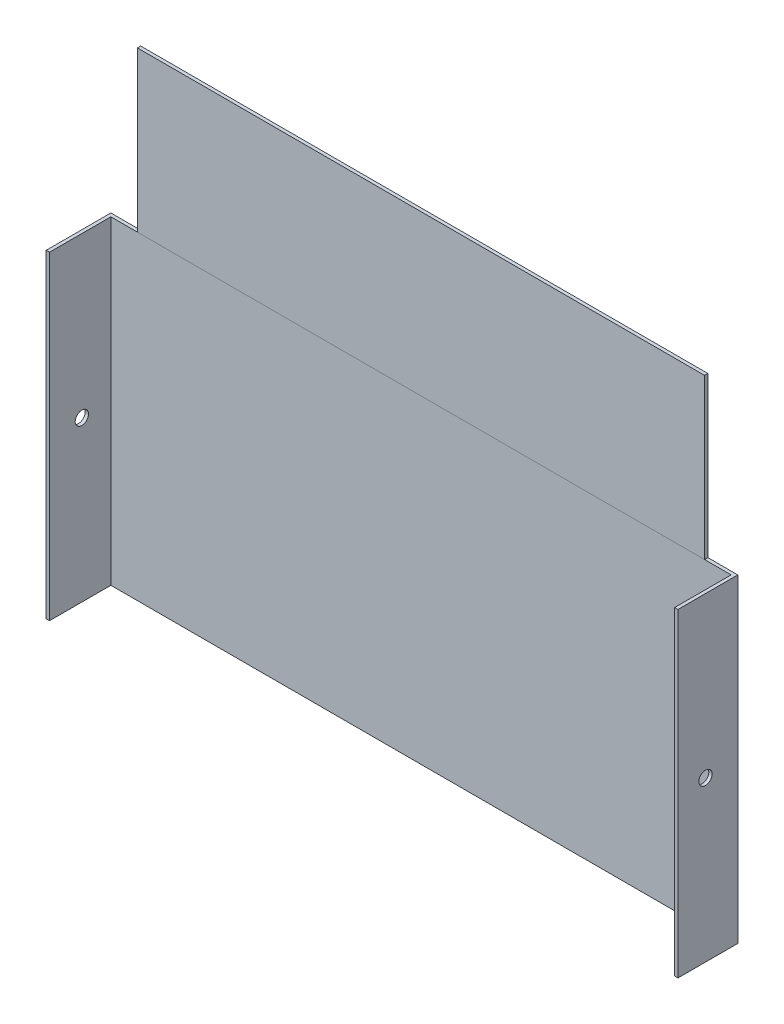
ISO-10303-21;
HEADER;
FILE_DESCRIPTION(('STEP AP214'),'2;1');
FILE_NAME('part.step','',(''),(''),'','','');
FILE_SCHEMA(('AUTOMOTIVE_DESIGN { 1 0 10303 214 1 1 1 1 }'));
ENDSEC;
DATA;
#1=APPLICATION_CONTEXT('core data for automotive mechanical design processes');
#2=APPLICATION_PROTOCOL_DEFINITION('international standard','automotive_design',2000,#1);
#3=PRODUCT_CONTEXT('',#1,'mechanical');
#4=PRODUCT('Part','Part','',(#3));
#5=PRODUCT_RELATED_PRODUCT_CATEGORY('part','',(#4));
#6=PRODUCT_DEFINITION_FORMATION('','',#4);
#7=PRODUCT_DEFINITION_CONTEXT('part definition',#1,'design');
#8=PRODUCT_DEFINITION('design','',#6,#7);
#9=PRODUCT_DEFINITION_SHAPE('','',#8);
#10=(LENGTH_UNIT() NAMED_UNIT(*) SI_UNIT(.MILLI.,.METRE.));
#11=(NAMED_UNIT(*) PLANE_ANGLE_UNIT() SI_UNIT($,.RADIAN.));
#12=(NAMED_UNIT(*) SI_UNIT($,.STERADIAN.) SOLID_ANGLE_UNIT());
#13=UNCERTAINTY_MEASURE_WITH_UNIT(LENGTH_MEASURE(1.E-05),#10,'distance_accuracy_value','');
#14=(GEOMETRIC_REPRESENTATION_CONTEXT(3) GLOBAL_UNCERTAINTY_ASSIGNED_CONTEXT((#13)) GLOBAL_UNIT_ASSIGNED_CONTEXT((#10,
#11,#12)) REPRESENTATION_CONTEXT('',''));
#15=CARTESIAN_POINT('',(0.,0.,0.));
#16=DIRECTION('',(0.,0.,1.));
#17=DIRECTION('',(1.,0.,0.));
#18=AXIS2_PLACEMENT_3D('',#15,#16,#17);
#19=CARTESIAN_POINT('',(0.,304.8,53.975));
#20=DIRECTION('',(0.,0.,-1.));
#21=DIRECTION('',(-1.,0.,0.));
#22=AXIS2_PLACEMENT_3D('',#19,#20,#21);
#23=PLANE('',#22);
#24=DIRECTION('',(1.,0.,0.));
#25=VECTOR('',#24,1.);
#26=CARTESIAN_POINT('',(0.,0.,53.975));
#27=LINE('',#26,#25);
#28=CARTESIAN_POINT('',(0.,0.,53.975));
#29=VERTEX_POINT('',#28);
#30=CARTESIAN_POINT('',(3.17500000000001,0.,53.975));
#31=VERTEX_POINT('',#30);
#32=EDGE_CURVE('E169',#29,#31,#27,.T.);
#33=ORIENTED_EDGE('',*,*,#32,.T.);
#34=DIRECTION('',(0.,-1.,0.));
#35=VECTOR('',#34,1.);
#36=CARTESIAN_POINT('',(3.17500000000001,304.8,53.975));
#37=LINE('',#36,#35);
#38=CARTESIAN_POINT('',(3.17500000000001,304.8,53.975));
#39=VERTEX_POINT('',#38);
#40=EDGE_CURVE('E223',#39,#31,#37,.T.);
#41=ORIENTED_EDGE('',*,*,#40,.F.);
#42=DIRECTION('',(1.,0.,0.));
#43=VECTOR('',#42,1.);
#44=CARTESIAN_POINT('',(0.,304.8,53.975));
#45=LINE('',#44,#43);
#46=CARTESIAN_POINT('',(0.,304.8,53.975));
#47=VERTEX_POINT('',#46);
#48=EDGE_CURVE('E173',#47,#39,#45,.T.);
#49=ORIENTED_EDGE('',*,*,#48,.F.);
#50=DIRECTION('',(0.,-1.,0.));
#51=VECTOR('',#50,1.);
#52=CARTESIAN_POINT('',(0.,304.8,53.975));
#53=LINE('',#52,#51);
#54=EDGE_CURVE('E36',#47,#29,#53,.T.);
#55=ORIENTED_EDGE('',*,*,#54,.T.);
#56=EDGE_LOOP('',(#33,#41,#49,#55));
#57=FACE_BOUND('',#56,.T.);
#58=ADVANCED_FACE('F33',(#57),#23,.F.);
#59=CARTESIAN_POINT('',(3.175,304.8,-4.56787261276633));
#60=DIRECTION('',(-1.,0.,0.));
#61=DIRECTION('',(0.,0.,1.));
#62=AXIS2_PLACEMENT_3D('',#59,#60,#61);
#63=PLANE('',#62);
#64=CARTESIAN_POINT('',(3.17500000000004,152.4,23.1160636936168));
#65=DIRECTION('',(-1.,0.,0.));
#66=DIRECTION('',(0.,0.,1.));
#67=AXIS2_PLACEMENT_3D('',#64,#65,#66);
#68=CIRCLE('',#67,6.35);
#69=CARTESIAN_POINT('',(3.17500000000004,152.4,29.4660636936168));
#70=VERTEX_POINT('',#69);
#71=EDGE_CURVE('E166',#70,#70,#68,.T.);
#72=ORIENTED_EDGE('',*,*,#71,.T.);
#73=EDGE_LOOP('',(#72));
#74=FACE_BOUND('',#73,.T.);
#75=DIRECTION('',(0.,0.,-1.));
#76=VECTOR('',#75,1.);
#77=CARTESIAN_POINT('',(3.175,0.,-4.56787261276633));
#78=LINE('',#77,#76);
#79=CARTESIAN_POINT('',(3.175,0.,-4.56787261276633));
#80=VERTEX_POINT('',#79);
#81=EDGE_CURVE('E193',#31,#80,#78,.T.);
#82=ORIENTED_EDGE('',*,*,#81,.T.);
#83=DIRECTION('',(0.,-1.,0.));
#84=VECTOR('',#83,1.);
#85=CARTESIAN_POINT('',(3.175,304.8,-4.56787261276633));
#86=LINE('',#85,#84);
#87=CARTESIAN_POINT('',(3.175,304.8,-4.56787261276633));
#88=VERTEX_POINT('',#87);
#89=EDGE_CURVE('E221',#88,#80,#86,.T.);
#90=ORIENTED_EDGE('',*,*,#89,.F.);
#91=DIRECTION('',(0.,0.,-1.));
#92=VECTOR('',#91,1.);
#93=CARTESIAN_POINT('',(3.175,304.8,-4.56787261276633));
#94=LINE('',#93,#92);
#95=EDGE_CURVE('E176',#39,#88,#94,.T.);
#96=ORIENTED_EDGE('',*,*,#95,.F.);
#97=ORIENTED_EDGE('',*,*,#40,.T.);
#98=EDGE_LOOP('',(#82,#90,#96,#97));
#99=FACE_BOUND('',#98,.T.);
#100=ADVANCED_FACE('F243',(#74,#99),#63,.F.);
#101=CARTESIAN_POINT('',(595.506256140345,304.8,-4.56787261276641));
#102=DIRECTION('',(0.,0.,-1.));
#103=DIRECTION('',(-1.,0.,0.));
#104=AXIS2_PLACEMENT_3D('',#101,#102,#103);
#105=PLANE('',#104);
#106=DIRECTION('',(1.,0.,0.));
#107=VECTOR('',#106,1.);
#108=CARTESIAN_POINT('',(595.506256140345,0.,-4.56787261276641));
#109=LINE('',#108,#107);
#110=CARTESIAN_POINT('',(595.506256140345,0.,-4.56787261276641));
#111=VERTEX_POINT('',#110);
#112=EDGE_CURVE('E195',#80,#111,#109,.T.);
#113=ORIENTED_EDGE('',*,*,#112,.T.);
#114=DIRECTION('',(0.,-1.,0.));
#115=VECTOR('',#114,1.);
#116=CARTESIAN_POINT('',(595.506256140345,304.8,-4.56787261276641));
#117=LINE('',#116,#115);
#118=CARTESIAN_POINT('',(595.506256140345,304.8,-4.56787261276641));
#119=VERTEX_POINT('',#118);
#120=EDGE_CURVE('E218',#119,#111,#117,.T.);
#121=ORIENTED_EDGE('',*,*,#120,.F.);
#122=DIRECTION('',(1.,0.,0.));
#123=VECTOR('',#122,1.);
#124=CARTESIAN_POINT('',(595.506256140345,304.8,-4.56787261276641));
#125=LINE('',#124,#123);
#126=CARTESIAN_POINT('',(570.106256140345,304.8,-4.5678726127664));
#127=VERTEX_POINT('',#126);
#128=EDGE_CURVE('E178',#127,#119,#125,.T.);
#129=ORIENTED_EDGE('',*,*,#128,.F.);
#130=CARTESIAN_POINT('',(28.575,304.8,-4.56787261276634));
#131=VERTEX_POINT('',#130);
#132=EDGE_CURVE('E182',#131,#127,#125,.T.);
#133=ORIENTED_EDGE('',*,*,#132,.F.);
#134=EDGE_CURVE('E179',#88,#131,#125,.T.);
#135=ORIENTED_EDGE('',*,*,#134,.F.);
#136=ORIENTED_EDGE('',*,*,#89,.T.);
#137=EDGE_LOOP('',(#113,#121,#129,#133,#135,#136));
#138=FACE_BOUND('',#137,.T.);
#139=ADVANCED_FACE('F246',(#138),#105,.F.);
#140=CARTESIAN_POINT('',(595.506256140345,304.8,-4.56787261276641));
#141=DIRECTION('',(1.,0.,0.));
#142=DIRECTION('',(0.,0.,-1.));
#143=AXIS2_PLACEMENT_3D('',#140,#141,#142);
#144=PLANE('',#143);
#145=CARTESIAN_POINT('',(595.506256140345,152.4,23.1160636936168));
#146=DIRECTION('',(1.,0.,0.));
#147=DIRECTION('',(0.,0.,-1.));
#148=AXIS2_PLACEMENT_3D('',#145,#146,#147);
#149=CIRCLE('',#148,6.35);
#150=CARTESIAN_POINT('',(595.506256140345,152.4,16.7660636936168));
#151=VERTEX_POINT('',#150);
#152=EDGE_CURVE('E162',#151,#151,#149,.T.);
#153=ORIENTED_EDGE('',*,*,#152,.T.);
#154=EDGE_LOOP('',(#153));
#155=FACE_BOUND('',#154,.T.);
#156=DIRECTION('',(0.,0.,1.));
#157=VECTOR('',#156,1.);
#158=CARTESIAN_POINT('',(595.506256140345,0.,-4.56787261276641));
#159=LINE('',#158,#157);
#160=CARTESIAN_POINT('',(595.506256140345,0.,49.4071273872337));
#161=VERTEX_POINT('',#160);
#162=EDGE_CURVE('E197',#111,#161,#159,.T.);
#163=ORIENTED_EDGE('',*,*,#162,.T.);
#164=DIRECTION('',(0.,-1.,0.));
#165=VECTOR('',#164,1.);
#166=CARTESIAN_POINT('',(595.506256140345,304.8,49.4071273872337));
#167=LINE('',#166,#165);
#168=CARTESIAN_POINT('',(595.506256140345,304.8,49.4071273872337));
#169=VERTEX_POINT('',#168);
#170=EDGE_CURVE('E215',#169,#161,#167,.T.);
#171=ORIENTED_EDGE('',*,*,#170,.F.);
#172=DIRECTION('',(0.,0.,1.));
#173=VECTOR('',#172,1.);
#174=CARTESIAN_POINT('',(595.506256140345,304.8,-4.56787261276641));
#175=LINE('',#174,#173);
#176=EDGE_CURVE('E181',#119,#169,#175,.T.);
#177=ORIENTED_EDGE('',*,*,#176,.F.);
#178=ORIENTED_EDGE('',*,*,#120,.T.);
#179=EDGE_LOOP('',(#163,#171,#177,#178));
#180=FACE_BOUND('',#179,.T.);
#181=ADVANCED_FACE('F284',(#155,#180),#144,.F.);
#182=CARTESIAN_POINT('',(598.681256140345,304.8,49.4071273872337));
#183=DIRECTION('',(0.,0.,-1.));
#184=DIRECTION('',(-1.,0.,0.));
#185=AXIS2_PLACEMENT_3D('',#182,#183,#184);
#186=PLANE('',#185);
#187=DIRECTION('',(1.,0.,0.));
#188=VECTOR('',#187,1.);
#189=CARTESIAN_POINT('',(598.681256140345,0.,49.4071273872337));
#190=LINE('',#189,#188);
#191=CARTESIAN_POINT('',(598.681256140345,0.,49.4071273872337));
#192=VERTEX_POINT('',#191);
#193=EDGE_CURVE('E199',#161,#192,#190,.T.);
#194=ORIENTED_EDGE('',*,*,#193,.T.);
#195=DIRECTION('',(0.,-1.,0.));
#196=VECTOR('',#195,1.);
#197=CARTESIAN_POINT('',(598.681256140345,304.8,49.4071273872337));
#198=LINE('',#197,#196);
#199=CARTESIAN_POINT('',(598.681256140345,304.8,49.4071273872337));
#200=VERTEX_POINT('',#199);
#201=EDGE_CURVE('E212',#200,#192,#198,.T.);
#202=ORIENTED_EDGE('',*,*,#201,.F.);
#203=DIRECTION('',(1.,0.,0.));
#204=VECTOR('',#203,1.);
#205=CARTESIAN_POINT('',(598.681256140345,304.8,49.4071273872337));
#206=LINE('',#205,#204);
#207=EDGE_CURVE('E184',#169,#200,#206,.T.);
#208=ORIENTED_EDGE('',*,*,#207,.F.);
#209=ORIENTED_EDGE('',*,*,#170,.T.);
#210=EDGE_LOOP('',(#194,#202,#208,#209));
#211=FACE_BOUND('',#210,.T.);
#212=ADVANCED_FACE('F289',(#211),#186,.F.);
#213=CARTESIAN_POINT('',(598.681256140345,304.8,-7.7428726127664));
#214=DIRECTION('',(-1.,0.,0.));
#215=DIRECTION('',(0.,0.,1.));
#216=AXIS2_PLACEMENT_3D('',#213,#214,#215);
#217=PLANE('',#216);
#218=CARTESIAN_POINT('',(598.681256140345,152.4,23.1160636936168));
#219=DIRECTION('',(-1.,0.,0.));
#220=DIRECTION('',(0.,0.,1.));
#221=AXIS2_PLACEMENT_3D('',#218,#219,#220);
#222=CIRCLE('',#221,6.35);
#223=CARTESIAN_POINT('',(598.681256140345,152.4,29.4660636936168));
#224=VERTEX_POINT('',#223);
#225=EDGE_CURVE('E155',#224,#224,#222,.T.);
#226=ORIENTED_EDGE('',*,*,#225,.T.);
#227=EDGE_LOOP('',(#226));
#228=FACE_BOUND('',#227,.T.);
#229=DIRECTION('',(0.,0.,-1.));
#230=VECTOR('',#229,1.);
#231=CARTESIAN_POINT('',(598.681256140345,0.,-7.7428726127664));
#232=LINE('',#231,#230);
#233=CARTESIAN_POINT('',(598.681256140345,0.,-7.7428726127664));
#234=VERTEX_POINT('',#233);
#235=EDGE_CURVE('E202',#192,#234,#232,.T.);
#236=ORIENTED_EDGE('',*,*,#235,.T.);
#237=DIRECTION('',(0.,-1.,0.));
#238=VECTOR('',#237,1.);
#239=CARTESIAN_POINT('',(598.681256140345,304.8,-7.7428726127664));
#240=LINE('',#239,#238);
#241=CARTESIAN_POINT('',(598.681256140345,304.8,-7.7428726127664));
#242=VERTEX_POINT('',#241);
#243=EDGE_CURVE('E209',#242,#234,#240,.T.);
#244=ORIENTED_EDGE('',*,*,#243,.F.);
#245=DIRECTION('',(0.,0.,-1.));
#246=VECTOR('',#245,1.);
#247=CARTESIAN_POINT('',(598.681256140345,304.8,-4.5678726127663));
#248=LINE('',#247,#246);
#249=EDGE_CURVE('E186',#200,#242,#248,.T.);
#250=ORIENTED_EDGE('',*,*,#249,.F.);
#251=ORIENTED_EDGE('',*,*,#201,.T.);
#252=EDGE_LOOP('',(#236,#244,#250,#251));
#253=FACE_BOUND('',#252,.T.);
#254=ADVANCED_FACE('F293',(#228,#253),#217,.F.);
#255=CARTESIAN_POINT('',(0.,304.8,-7.7428726127664));
#256=DIRECTION('',(0.,0.,1.));
#257=DIRECTION('',(1.,0.,0.));
#258=AXIS2_PLACEMENT_3D('',#255,#256,#257);
#259=PLANE('',#258);
#260=DIRECTION('',(-1.,0.,0.));
#261=VECTOR('',#260,1.);
#262=CARTESIAN_POINT('',(0.,0.,-7.7428726127664));
#263=LINE('',#262,#261);
#264=CARTESIAN_POINT('',(0.,0.,-7.7428726127664));
#265=VERTEX_POINT('',#264);
#266=EDGE_CURVE('E204',#234,#265,#263,.T.);
#267=ORIENTED_EDGE('',*,*,#266,.T.);
#268=DIRECTION('',(0.,-1.,0.));
#269=VECTOR('',#268,1.);
#270=CARTESIAN_POINT('',(0.,304.8,-7.7428726127664));
#271=LINE('',#270,#269);
#272=CARTESIAN_POINT('',(0.,304.8,-7.7428726127664));
#273=VERTEX_POINT('',#272);
#274=EDGE_CURVE('E191',#273,#265,#271,.T.);
#275=ORIENTED_EDGE('',*,*,#274,.F.);
#276=DIRECTION('',(-1.,0.,0.));
#277=VECTOR('',#276,1.);
#278=CARTESIAN_POINT('',(0.,304.8,-7.7428726127664));
#279=LINE('',#278,#277);
#280=EDGE_CURVE('E188',#242,#273,#279,.T.);
#281=ORIENTED_EDGE('',*,*,#280,.F.);
#282=ORIENTED_EDGE('',*,*,#243,.T.);
#283=EDGE_LOOP('',(#267,#275,#281,#282));
#284=FACE_BOUND('',#283,.T.);
#285=ADVANCED_FACE('F297',(#284),#259,.F.);
#286=CARTESIAN_POINT('',(0.,304.8,0.));
#287=DIRECTION('',(1.,0.,0.));
#288=DIRECTION('',(0.,0.,-1.));
#289=AXIS2_PLACEMENT_3D('',#286,#287,#288);
#290=PLANE('',#289);
#291=CARTESIAN_POINT('',(0.,152.4,23.1160636936168));
#292=DIRECTION('',(-1.,0.,0.));
#293=DIRECTION('',(0.,0.,1.));
#294=AXIS2_PLACEMENT_3D('',#291,#292,#293);
#295=CIRCLE('',#294,6.35);
#296=CARTESIAN_POINT('',(0.,152.4,29.4660636936168));
#297=VERTEX_POINT('',#296);
#298=EDGE_CURVE('E152',#297,#297,#295,.T.);
#299=ORIENTED_EDGE('',*,*,#298,.F.);
#300=EDGE_LOOP('',(#299));
#301=FACE_BOUND('',#300,.T.);
#302=DIRECTION('',(0.,0.,1.));
#303=VECTOR('',#302,1.);
#304=CARTESIAN_POINT('',(0.,0.,0.));
#305=LINE('',#304,#303);
#306=EDGE_CURVE('E174',#265,#29,#305,.T.);
#307=ORIENTED_EDGE('',*,*,#306,.T.);
#308=ORIENTED_EDGE('',*,*,#54,.F.);
#309=DIRECTION('',(0.,0.,1.));
#310=VECTOR('',#309,1.);
#311=CARTESIAN_POINT('',(0.,304.8,0.));
#312=LINE('',#311,#310);
#313=EDGE_CURVE('E170',#273,#47,#312,.T.);
#314=ORIENTED_EDGE('',*,*,#313,.F.);
#315=ORIENTED_EDGE('',*,*,#274,.T.);
#316=EDGE_LOOP('',(#307,#308,#314,#315));
#317=FACE_BOUND('',#316,.T.);
#318=ADVANCED_FACE('F234',(#301,#317),#290,.F.);
#319=CARTESIAN_POINT('',(0.,304.8,0.));
#320=DIRECTION('',(0.,1.,0.));
#321=DIRECTION('',(0.,0.,1.));
#322=AXIS2_PLACEMENT_3D('',#319,#320,#321);
#323=PLANE('',#322);
#324=DIRECTION('',(0.,0.,1.));
#325=VECTOR('',#324,1.);
#326=CARTESIAN_POINT('',(28.575,304.8,-7.64591667464742));
#327=LINE('',#326,#325);
#328=CARTESIAN_POINT('',(28.575,304.8,-7.64591667464742));
#329=VERTEX_POINT('',#328);
#330=EDGE_CURVE('E49',#329,#131,#327,.T.);
#331=ORIENTED_EDGE('',*,*,#330,.F.);
#332=DIRECTION('',(-1.,0.,0.));
#333=VECTOR('',#332,1.);
#334=CARTESIAN_POINT('',(28.575,304.8,-7.64591667464742));
#335=LINE('',#334,#333);
#336=CARTESIAN_POINT('',(570.106256140345,304.8,-7.64591667464742));
#337=VERTEX_POINT('',#336);
#338=EDGE_CURVE('E146',#337,#329,#335,.T.);
#339=ORIENTED_EDGE('',*,*,#338,.F.);
#340=DIRECTION('',(0.,0.,-1.));
#341=VECTOR('',#340,1.);
#342=CARTESIAN_POINT('',(570.106256140345,304.8,-7.64591667464742));
#343=LINE('',#342,#341);
#344=EDGE_CURVE('E11',#127,#337,#343,.T.);
#345=ORIENTED_EDGE('',*,*,#344,.F.);
#346=ORIENTED_EDGE('',*,*,#128,.T.);
#347=ORIENTED_EDGE('',*,*,#176,.T.);
#348=ORIENTED_EDGE('',*,*,#207,.T.);
#349=ORIENTED_EDGE('',*,*,#249,.T.);
#350=ORIENTED_EDGE('',*,*,#280,.T.);
#351=ORIENTED_EDGE('',*,*,#313,.T.);
#352=ORIENTED_EDGE('',*,*,#48,.T.);
#353=ORIENTED_EDGE('',*,*,#95,.T.);
#354=ORIENTED_EDGE('',*,*,#134,.T.);
#355=EDGE_LOOP('',(#331,#339,#345,#346,#347,#348,#349,#350,#351,#352,#353,#354));
#356=FACE_BOUND('',#355,.T.);
#357=ADVANCED_FACE('F249',(#356),#323,.T.);
#358=CARTESIAN_POINT('',(0.,0.,0.));
#359=DIRECTION('',(0.,1.,0.));
#360=DIRECTION('',(0.,0.,1.));
#361=AXIS2_PLACEMENT_3D('',#358,#359,#360);
#362=PLANE('',#361);
#363=ORIENTED_EDGE('',*,*,#32,.F.);
#364=ORIENTED_EDGE('',*,*,#306,.F.);
#365=ORIENTED_EDGE('',*,*,#266,.F.);
#366=ORIENTED_EDGE('',*,*,#235,.F.);
#367=ORIENTED_EDGE('',*,*,#193,.F.);
#368=ORIENTED_EDGE('',*,*,#162,.F.);
#369=ORIENTED_EDGE('',*,*,#112,.F.);
#370=ORIENTED_EDGE('',*,*,#81,.F.);
#371=EDGE_LOOP('',(#363,#364,#365,#366,#367,#368,#369,#370));
#372=FACE_BOUND('',#371,.T.);
#373=ADVANCED_FACE('F239',(#372),#362,.F.);
#374=CARTESIAN_POINT('',(598.681256140345,152.4,23.1160636936168));
#375=DIRECTION('',(-1.,0.,0.));
#376=DIRECTION('',(0.,0.,1.));
#377=AXIS2_PLACEMENT_3D('',#374,#375,#376);
#378=CYLINDRICAL_SURFACE('',#377,6.35);
#379=ORIENTED_EDGE('',*,*,#298,.T.);
#380=EDGE_LOOP('',(#379));
#381=FACE_BOUND('',#380,.T.);
#382=ORIENTED_EDGE('',*,*,#71,.F.);
#383=EDGE_LOOP('',(#382));
#384=FACE_BOUND('',#383,.T.);
#385=ADVANCED_FACE('F307',(#381,#384),#378,.F.);
#386=ORIENTED_EDGE('',*,*,#225,.F.);
#387=EDGE_LOOP('',(#386));
#388=FACE_BOUND('',#387,.T.);
#389=ORIENTED_EDGE('',*,*,#152,.F.);
#390=EDGE_LOOP('',(#389));
#391=FACE_BOUND('',#390,.T.);
#392=ADVANCED_FACE('F312',(#388,#391),#378,.F.);
#393=CARTESIAN_POINT('',(0.,304.8,0.));
#394=DIRECTION('',(0.,1.,0.));
#395=DIRECTION('',(0.,0.,1.));
#396=AXIS2_PLACEMENT_3D('',#393,#394,#395);
#397=PLANE('',#396);
#398=CARTESIAN_POINT('',(28.575,304.8,-4.53125552789402));
#399=VERTEX_POINT('',#398);
#400=EDGE_CURVE('E150',#131,#399,#327,.T.);
#401=ORIENTED_EDGE('',*,*,#400,.F.);
#402=ORIENTED_EDGE('',*,*,#132,.T.);
#403=CARTESIAN_POINT('',(570.106256140345,304.8,-4.53125552789402));
#404=VERTEX_POINT('',#403);
#405=EDGE_CURVE('E42',#404,#127,#343,.T.);
#406=ORIENTED_EDGE('',*,*,#405,.F.);
#407=DIRECTION('',(1.,0.,0.));
#408=VECTOR('',#407,1.);
#409=CARTESIAN_POINT('',(28.575,304.8,-4.53125552789402));
#410=LINE('',#409,#408);
#411=EDGE_CURVE('E254',#399,#404,#410,.T.);
#412=ORIENTED_EDGE('',*,*,#411,.F.);
#413=EDGE_LOOP('',(#401,#402,#406,#412));
#414=FACE_BOUND('',#413,.T.);
#415=ADVANCED_FACE('F251',(#414),#397,.F.);
#416=CARTESIAN_POINT('',(28.575,457.2,-7.64591667464742));
#417=DIRECTION('',(1.,0.,0.));
#418=DIRECTION('',(0.,0.,-1.));
#419=AXIS2_PLACEMENT_3D('',#416,#417,#418);
#420=PLANE('',#419);
#421=ORIENTED_EDGE('',*,*,#330,.T.);
#422=ORIENTED_EDGE('',*,*,#400,.T.);
#423=DIRECTION('',(0.,-1.,0.));
#424=VECTOR('',#423,1.);
#425=CARTESIAN_POINT('',(28.575,457.2,-4.53125552789402));
#426=LINE('',#425,#424);
#427=CARTESIAN_POINT('',(28.575,457.2,-4.53125552789402));
#428=VERTEX_POINT('',#427);
#429=EDGE_CURVE('E131',#428,#399,#426,.T.);
#430=ORIENTED_EDGE('',*,*,#429,.F.);
#431=DIRECTION('',(0.,0.,1.));
#432=VECTOR('',#431,1.);
#433=CARTESIAN_POINT('',(28.575,457.2,-7.64591667464742));
#434=LINE('',#433,#432);
#435=CARTESIAN_POINT('',(28.575,457.2,-7.64591667464742));
#436=VERTEX_POINT('',#435);
#437=EDGE_CURVE('E137',#436,#428,#434,.T.);
#438=ORIENTED_EDGE('',*,*,#437,.F.);
#439=DIRECTION('',(0.,-1.,0.));
#440=VECTOR('',#439,1.);
#441=CARTESIAN_POINT('',(28.575,457.2,-7.64591667464742));
#442=LINE('',#441,#440);
#443=EDGE_CURVE('E256',#436,#329,#442,.T.);
#444=ORIENTED_EDGE('',*,*,#443,.T.);
#445=EDGE_LOOP('',(#421,#422,#430,#438,#444));
#446=FACE_BOUND('',#445,.T.);
#447=ADVANCED_FACE('F148',(#446),#420,.F.);
#448=CARTESIAN_POINT('',(28.575,457.2,-4.53125552789402));
#449=DIRECTION('',(0.,0.,-1.));
#450=DIRECTION('',(-1.,0.,0.));
#451=AXIS2_PLACEMENT_3D('',#448,#449,#450);
#452=PLANE('',#451);
#453=ORIENTED_EDGE('',*,*,#411,.T.);
#454=DIRECTION('',(0.,-1.,0.));
#455=VECTOR('',#454,1.);
#456=CARTESIAN_POINT('',(570.106256140345,457.2,-4.53125552789402));
#457=LINE('',#456,#455);
#458=CARTESIAN_POINT('',(570.106256140345,457.2,-4.53125552789402));
#459=VERTEX_POINT('',#458);
#460=EDGE_CURVE('E133',#459,#404,#457,.T.);
#461=ORIENTED_EDGE('',*,*,#460,.F.);
#462=DIRECTION('',(1.,0.,0.));
#463=VECTOR('',#462,1.);
#464=CARTESIAN_POINT('',(28.575,457.2,-4.53125552789402));
#465=LINE('',#464,#463);
#466=EDGE_CURVE('E127',#428,#459,#465,.T.);
#467=ORIENTED_EDGE('',*,*,#466,.F.);
#468=ORIENTED_EDGE('',*,*,#429,.T.);
#469=EDGE_LOOP('',(#453,#461,#467,#468));
#470=FACE_BOUND('',#469,.T.);
#471=ADVANCED_FACE('F129',(#470),#452,.F.);
#472=CARTESIAN_POINT('',(570.106256140345,457.2,-7.64591667464742));
#473=DIRECTION('',(-1.,0.,0.));
#474=DIRECTION('',(0.,0.,1.));
#475=AXIS2_PLACEMENT_3D('',#472,#473,#474);
#476=PLANE('',#475);
#477=ORIENTED_EDGE('',*,*,#405,.T.);
#478=ORIENTED_EDGE('',*,*,#344,.T.);
#479=DIRECTION('',(0.,-1.,0.));
#480=VECTOR('',#479,1.);
#481=CARTESIAN_POINT('',(570.106256140345,457.2,-7.64591667464742));
#482=LINE('',#481,#480);
#483=CARTESIAN_POINT('',(570.106256140345,457.2,-7.64591667464742));
#484=VERTEX_POINT('',#483);
#485=EDGE_CURVE('E157',#484,#337,#482,.T.);
#486=ORIENTED_EDGE('',*,*,#485,.F.);
#487=DIRECTION('',(0.,0.,-1.));
#488=VECTOR('',#487,1.);
#489=CARTESIAN_POINT('',(570.106256140345,457.2,-7.64591667464742));
#490=LINE('',#489,#488);
#491=EDGE_CURVE('E136',#459,#484,#490,.T.);
#492=ORIENTED_EDGE('',*,*,#491,.F.);
#493=ORIENTED_EDGE('',*,*,#460,.T.);
#494=EDGE_LOOP('',(#477,#478,#486,#492,#493));
#495=FACE_BOUND('',#494,.T.);
#496=ADVANCED_FACE('F267',(#495),#476,.F.);
#497=CARTESIAN_POINT('',(28.575,457.2,-7.64591667464742));
#498=DIRECTION('',(0.,0.,1.));
#499=DIRECTION('',(1.,0.,0.));
#500=AXIS2_PLACEMENT_3D('',#497,#498,#499);
#501=PLANE('',#500);
#502=ORIENTED_EDGE('',*,*,#338,.T.);
#503=ORIENTED_EDGE('',*,*,#443,.F.);
#504=DIRECTION('',(-1.,0.,0.));
#505=VECTOR('',#504,1.);
#506=CARTESIAN_POINT('',(28.575,457.2,-7.64591667464742));
#507=LINE('',#506,#505);
#508=EDGE_CURVE('E142',#484,#436,#507,.T.);
#509=ORIENTED_EDGE('',*,*,#508,.F.);
#510=ORIENTED_EDGE('',*,*,#485,.T.);
#511=EDGE_LOOP('',(#502,#503,#509,#510));
#512=FACE_BOUND('',#511,.T.);
#513=ADVANCED_FACE('F265',(#512),#501,.F.);
#514=CARTESIAN_POINT('',(0.,457.2,0.));
#515=DIRECTION('',(0.,1.,0.));
#516=DIRECTION('',(0.,0.,1.));
#517=AXIS2_PLACEMENT_3D('',#514,#515,#516);
#518=PLANE('',#517);
#519=ORIENTED_EDGE('',*,*,#437,.T.);
#520=ORIENTED_EDGE('',*,*,#466,.T.);
#521=ORIENTED_EDGE('',*,*,#491,.T.);
#522=ORIENTED_EDGE('',*,*,#508,.T.);
#523=EDGE_LOOP('',(#519,#520,#521,#522));
#524=FACE_BOUND('',#523,.T.);
#525=ADVANCED_FACE('F140',(#524),#518,.T.);
#526=CLOSED_SHELL('',(#58,#100,#139,#181,#212,#254,#285,#318,#357,#373,#385,#392,#415,#447,#471,
#496,#513,#525));
#527=MANIFOLD_SOLID_BREP('B2',#526);
#528=ADVANCED_BREP_SHAPE_REPRESENTATION('',(#18,#527),#14);
#529=SHAPE_DEFINITION_REPRESENTATION(#9,#528);
ENDSEC;
END-ISO-10303-21;
